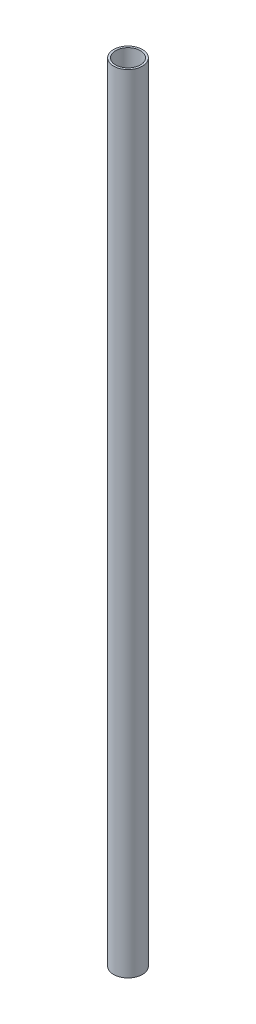
ISO-10303-21;
HEADER;
FILE_DESCRIPTION(('STEP AP214'),'2;1');
FILE_NAME('part.step','',(''),(''),'','','');
FILE_SCHEMA(('AUTOMOTIVE_DESIGN { 1 0 10303 214 1 1 1 1 }'));
ENDSEC;
DATA;
#1=APPLICATION_CONTEXT('core data for automotive mechanical design processes');
#2=APPLICATION_PROTOCOL_DEFINITION('international standard','automotive_design',2000,#1);
#3=PRODUCT_CONTEXT('',#1,'mechanical');
#4=PRODUCT('Part','Part','',(#3));
#5=PRODUCT_RELATED_PRODUCT_CATEGORY('part','',(#4));
#6=PRODUCT_DEFINITION_FORMATION('','',#4);
#7=PRODUCT_DEFINITION_CONTEXT('part definition',#1,'design');
#8=PRODUCT_DEFINITION('design','',#6,#7);
#9=PRODUCT_DEFINITION_SHAPE('','',#8);
#10=(LENGTH_UNIT() NAMED_UNIT(*) SI_UNIT(.MILLI.,.METRE.));
#11=(NAMED_UNIT(*) PLANE_ANGLE_UNIT() SI_UNIT($,.RADIAN.));
#12=(NAMED_UNIT(*) SI_UNIT($,.STERADIAN.) SOLID_ANGLE_UNIT());
#13=UNCERTAINTY_MEASURE_WITH_UNIT(LENGTH_MEASURE(1.E-05),#10,'distance_accuracy_value','');
#14=(GEOMETRIC_REPRESENTATION_CONTEXT(3) GLOBAL_UNCERTAINTY_ASSIGNED_CONTEXT((#13)) GLOBAL_UNIT_ASSIGNED_CONTEXT((#10,
#11,#12)) REPRESENTATION_CONTEXT('',''));
#15=CARTESIAN_POINT('',(0.,0.,0.));
#16=DIRECTION('',(0.,0.,1.));
#17=DIRECTION('',(1.,0.,0.));
#18=AXIS2_PLACEMENT_3D('',#15,#16,#17);
#19=CARTESIAN_POINT('',(0.,692.15,0.));
#20=DIRECTION('',(0.,1.,0.));
#21=DIRECTION('',(0.,0.,1.));
#22=AXIS2_PLACEMENT_3D('',#19,#20,#21);
#23=PLANE('',#22);
#24=CARTESIAN_POINT('',(0.,692.15,0.));
#25=DIRECTION('',(0.,1.,0.));
#26=DIRECTION('',(0.,0.,1.));
#27=AXIS2_PLACEMENT_3D('',#24,#25,#26);
#28=CIRCLE('',#27,12.7);
#29=CARTESIAN_POINT('',(0.,692.15,12.7));
#30=VERTEX_POINT('',#29);
#31=EDGE_CURVE('E10',#30,#30,#28,.T.);
#32=ORIENTED_EDGE('',*,*,#31,.T.);
#33=EDGE_LOOP('',(#32));
#34=FACE_BOUND('',#33,.T.);
#35=CARTESIAN_POINT('',(0.,692.15,0.));
#36=DIRECTION('',(0.,1.,0.));
#37=DIRECTION('',(0.,0.,1.));
#38=AXIS2_PLACEMENT_3D('',#35,#36,#37);
#39=CIRCLE('',#38,10.922);
#40=CARTESIAN_POINT('',(0.,692.15,10.922));
#41=VERTEX_POINT('',#40);
#42=EDGE_CURVE('E50',#41,#41,#39,.T.);
#43=ORIENTED_EDGE('',*,*,#42,.F.);
#44=EDGE_LOOP('',(#43));
#45=FACE_BOUND('',#44,.T.);
#46=ADVANCED_FACE('F37',(#34,#45),#23,.T.);
#47=CARTESIAN_POINT('',(0.,0.,0.));
#48=DIRECTION('',(0.,1.,0.));
#49=DIRECTION('',(0.,0.,1.));
#50=AXIS2_PLACEMENT_3D('',#47,#48,#49);
#51=PLANE('',#50);
#52=CARTESIAN_POINT('',(0.,0.,0.));
#53=DIRECTION('',(0.,1.,0.));
#54=DIRECTION('',(0.,0.,1.));
#55=AXIS2_PLACEMENT_3D('',#52,#53,#54);
#56=CIRCLE('',#55,12.7);
#57=CARTESIAN_POINT('',(0.,0.,12.7));
#58=VERTEX_POINT('',#57);
#59=EDGE_CURVE('E41',#58,#58,#56,.T.);
#60=ORIENTED_EDGE('',*,*,#59,.F.);
#61=EDGE_LOOP('',(#60));
#62=FACE_BOUND('',#61,.T.);
#63=CARTESIAN_POINT('',(0.,0.,0.));
#64=DIRECTION('',(0.,1.,0.));
#65=DIRECTION('',(0.,0.,1.));
#66=AXIS2_PLACEMENT_3D('',#63,#64,#65);
#67=CIRCLE('',#66,10.922);
#68=CARTESIAN_POINT('',(0.,0.,10.922));
#69=VERTEX_POINT('',#68);
#70=EDGE_CURVE('E52',#69,#69,#67,.T.);
#71=ORIENTED_EDGE('',*,*,#70,.T.);
#72=EDGE_LOOP('',(#71));
#73=FACE_BOUND('',#72,.T.);
#74=ADVANCED_FACE('F64',(#62,#73),#51,.F.);
#75=CARTESIAN_POINT('',(0.,692.15,0.));
#76=DIRECTION('',(0.,-1.,0.));
#77=DIRECTION('',(0.,0.,-1.));
#78=AXIS2_PLACEMENT_3D('',#75,#76,#77);
#79=CYLINDRICAL_SURFACE('',#78,12.7);
#80=ORIENTED_EDGE('',*,*,#31,.F.);
#81=EDGE_LOOP('',(#80));
#82=FACE_BOUND('',#81,.T.);
#83=ORIENTED_EDGE('',*,*,#59,.T.);
#84=EDGE_LOOP('',(#83));
#85=FACE_BOUND('',#84,.T.);
#86=ADVANCED_FACE('F39',(#82,#85),#79,.T.);
#87=CARTESIAN_POINT('',(0.,692.15,0.));
#88=DIRECTION('',(0.,-1.,0.));
#89=DIRECTION('',(0.,0.,-1.));
#90=AXIS2_PLACEMENT_3D('',#87,#88,#89);
#91=CYLINDRICAL_SURFACE('',#90,10.922);
#92=ORIENTED_EDGE('',*,*,#42,.T.);
#93=EDGE_LOOP('',(#92));
#94=FACE_BOUND('',#93,.T.);
#95=ORIENTED_EDGE('',*,*,#70,.F.);
#96=EDGE_LOOP('',(#95));
#97=FACE_BOUND('',#96,.T.);
#98=ADVANCED_FACE('F60',(#94,#97),#91,.F.);
#99=CLOSED_SHELL('',(#46,#74,#86,#98));
#100=MANIFOLD_SOLID_BREP('B2',#99);
#101=ADVANCED_BREP_SHAPE_REPRESENTATION('',(#18,#100),#14);
#102=SHAPE_DEFINITION_REPRESENTATION(#9,#101);
ENDSEC;
END-ISO-10303-21;
